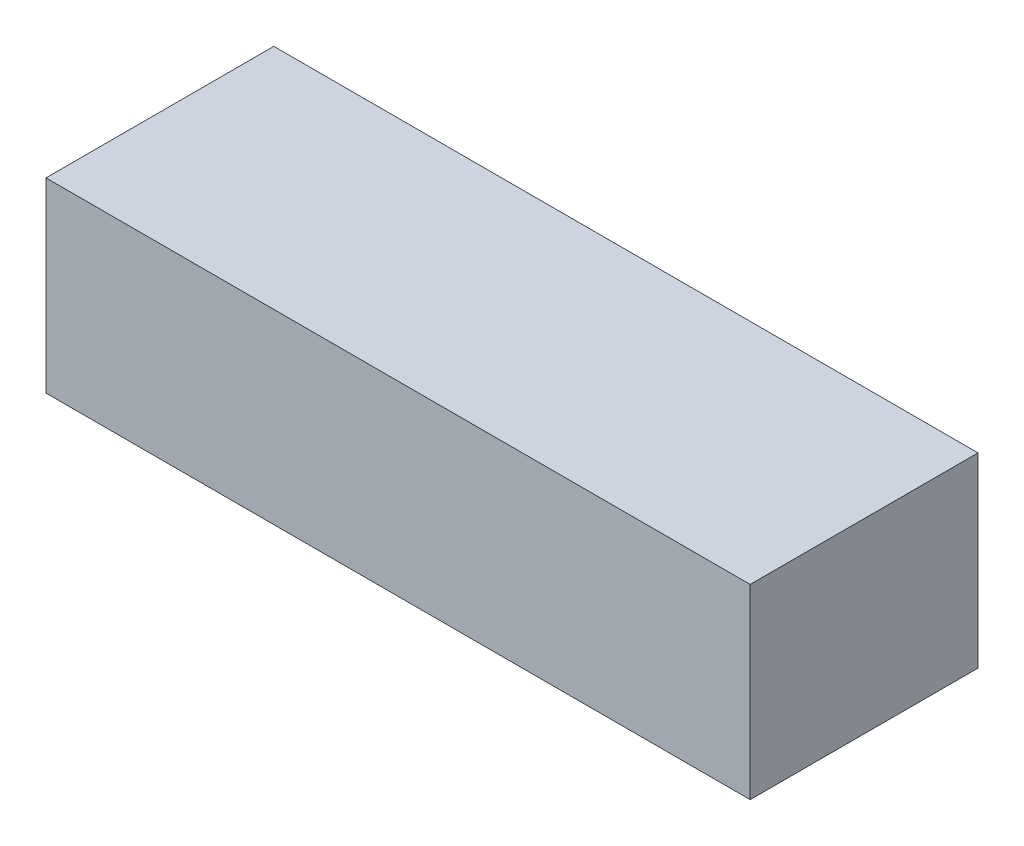
ISO-10303-21;
HEADER;
FILE_DESCRIPTION(('STEP AP214'),'2;1');
FILE_NAME('part.step','',(''),(''),'','','');
FILE_SCHEMA(('AUTOMOTIVE_DESIGN { 1 0 10303 214 1 1 1 1 }'));
ENDSEC;
DATA;
#1=APPLICATION_CONTEXT('core data for automotive mechanical design processes');
#2=APPLICATION_PROTOCOL_DEFINITION('international standard','automotive_design',2000,#1);
#3=PRODUCT_CONTEXT('',#1,'mechanical');
#4=PRODUCT('Part','Part','',(#3));
#5=PRODUCT_RELATED_PRODUCT_CATEGORY('part','',(#4));
#6=PRODUCT_DEFINITION_FORMATION('','',#4);
#7=PRODUCT_DEFINITION_CONTEXT('part definition',#1,'design');
#8=PRODUCT_DEFINITION('design','',#6,#7);
#9=PRODUCT_DEFINITION_SHAPE('','',#8);
#10=(LENGTH_UNIT() NAMED_UNIT(*) SI_UNIT(.MILLI.,.METRE.));
#11=(NAMED_UNIT(*) PLANE_ANGLE_UNIT() SI_UNIT($,.RADIAN.));
#12=(NAMED_UNIT(*) SI_UNIT($,.STERADIAN.) SOLID_ANGLE_UNIT());
#13=UNCERTAINTY_MEASURE_WITH_UNIT(LENGTH_MEASURE(1.E-05),#10,'distance_accuracy_value','');
#14=(GEOMETRIC_REPRESENTATION_CONTEXT(3) GLOBAL_UNCERTAINTY_ASSIGNED_CONTEXT((#13)) GLOBAL_UNIT_ASSIGNED_CONTEXT((#10,
#11,#12)) REPRESENTATION_CONTEXT('',''));
#15=CARTESIAN_POINT('',(0.,0.,0.));
#16=DIRECTION('',(0.,0.,1.));
#17=DIRECTION('',(1.,0.,0.));
#18=AXIS2_PLACEMENT_3D('',#15,#16,#17);
#19=CARTESIAN_POINT('',(0.,27.,0.));
#20=DIRECTION('',(1.,0.,0.));
#21=DIRECTION('',(0.,0.,-1.));
#22=AXIS2_PLACEMENT_3D('',#19,#20,#21);
#23=PLANE('',#22);
#24=DIRECTION('',(0.,0.,1.));
#25=VECTOR('',#24,1.);
#26=CARTESIAN_POINT('',(0.,0.,0.));
#27=LINE('',#26,#25);
#28=CARTESIAN_POINT('',(0.,0.,-33.));
#29=VERTEX_POINT('',#28);
#30=CARTESIAN_POINT('',(0.,0.,0.));
#31=VERTEX_POINT('',#30);
#32=EDGE_CURVE('E107',#29,#31,#27,.T.);
#33=ORIENTED_EDGE('',*,*,#32,.T.);
#34=DIRECTION('',(0.,-1.,0.));
#35=VECTOR('',#34,1.);
#36=CARTESIAN_POINT('',(0.,27.,0.));
#37=LINE('',#36,#35);
#38=CARTESIAN_POINT('',(0.,27.,0.));
#39=VERTEX_POINT('',#38);
#40=EDGE_CURVE('E11',#39,#31,#37,.T.);
#41=ORIENTED_EDGE('',*,*,#40,.F.);
#42=DIRECTION('',(0.,0.,1.));
#43=VECTOR('',#42,1.);
#44=CARTESIAN_POINT('',(0.,27.,0.));
#45=LINE('',#44,#43);
#46=CARTESIAN_POINT('',(0.,27.,-33.));
#47=VERTEX_POINT('',#46);
#48=EDGE_CURVE('E91',#47,#39,#45,.T.);
#49=ORIENTED_EDGE('',*,*,#48,.F.);
#50=DIRECTION('',(0.,-1.,0.));
#51=VECTOR('',#50,1.);
#52=CARTESIAN_POINT('',(0.,27.,-33.));
#53=LINE('',#52,#51);
#54=EDGE_CURVE('E103',#47,#29,#53,.T.);
#55=ORIENTED_EDGE('',*,*,#54,.T.);
#56=EDGE_LOOP('',(#33,#41,#49,#55));
#57=FACE_BOUND('',#56,.T.);
#58=ADVANCED_FACE('F39',(#57),#23,.F.);
#59=CARTESIAN_POINT('',(0.,27.,0.));
#60=DIRECTION('',(0.,0.,-1.));
#61=DIRECTION('',(-1.,0.,0.));
#62=AXIS2_PLACEMENT_3D('',#59,#60,#61);
#63=PLANE('',#62);
#64=DIRECTION('',(1.,0.,0.));
#65=VECTOR('',#64,1.);
#66=CARTESIAN_POINT('',(0.,0.,0.));
#67=LINE('',#66,#65);
#68=CARTESIAN_POINT('',(102.,0.,0.));
#69=VERTEX_POINT('',#68);
#70=EDGE_CURVE('E96',#31,#69,#67,.T.);
#71=ORIENTED_EDGE('',*,*,#70,.T.);
#72=DIRECTION('',(0.,-1.,0.));
#73=VECTOR('',#72,1.);
#74=CARTESIAN_POINT('',(102.,27.,0.));
#75=LINE('',#74,#73);
#76=CARTESIAN_POINT('',(102.,27.,0.));
#77=VERTEX_POINT('',#76);
#78=EDGE_CURVE('E48',#77,#69,#75,.T.);
#79=ORIENTED_EDGE('',*,*,#78,.F.);
#80=DIRECTION('',(1.,0.,0.));
#81=VECTOR('',#80,1.);
#82=CARTESIAN_POINT('',(0.,27.,0.));
#83=LINE('',#82,#81);
#84=EDGE_CURVE('E86',#39,#77,#83,.T.);
#85=ORIENTED_EDGE('',*,*,#84,.F.);
#86=ORIENTED_EDGE('',*,*,#40,.T.);
#87=EDGE_LOOP('',(#71,#79,#85,#86));
#88=FACE_BOUND('',#87,.T.);
#89=ADVANCED_FACE('F95',(#88),#63,.F.);
#90=CARTESIAN_POINT('',(102.,27.,0.));
#91=DIRECTION('',(-1.,0.,0.));
#92=DIRECTION('',(0.,0.,1.));
#93=AXIS2_PLACEMENT_3D('',#90,#91,#92);
#94=PLANE('',#93);
#95=DIRECTION('',(0.,0.,-1.));
#96=VECTOR('',#95,1.);
#97=CARTESIAN_POINT('',(102.,0.,0.));
#98=LINE('',#97,#96);
#99=CARTESIAN_POINT('',(102.,0.,-33.));
#100=VERTEX_POINT('',#99);
#101=EDGE_CURVE('E73',#69,#100,#98,.T.);
#102=ORIENTED_EDGE('',*,*,#101,.T.);
#103=DIRECTION('',(0.,-1.,0.));
#104=VECTOR('',#103,1.);
#105=CARTESIAN_POINT('',(102.,27.,-33.));
#106=LINE('',#105,#104);
#107=CARTESIAN_POINT('',(102.,27.,-33.));
#108=VERTEX_POINT('',#107);
#109=EDGE_CURVE('E98',#108,#100,#106,.T.);
#110=ORIENTED_EDGE('',*,*,#109,.F.);
#111=DIRECTION('',(0.,0.,-1.));
#112=VECTOR('',#111,1.);
#113=CARTESIAN_POINT('',(102.,27.,0.));
#114=LINE('',#113,#112);
#115=EDGE_CURVE('E89',#77,#108,#114,.T.);
#116=ORIENTED_EDGE('',*,*,#115,.F.);
#117=ORIENTED_EDGE('',*,*,#78,.T.);
#118=EDGE_LOOP('',(#102,#110,#116,#117));
#119=FACE_BOUND('',#118,.T.);
#120=ADVANCED_FACE('F99',(#119),#94,.F.);
#121=CARTESIAN_POINT('',(0.,27.,-33.));
#122=DIRECTION('',(0.,0.,1.));
#123=DIRECTION('',(1.,0.,0.));
#124=AXIS2_PLACEMENT_3D('',#121,#122,#123);
#125=PLANE('',#124);
#126=DIRECTION('',(-1.,0.,0.));
#127=VECTOR('',#126,1.);
#128=CARTESIAN_POINT('',(0.,0.,-33.));
#129=LINE('',#128,#127);
#130=EDGE_CURVE('E79',#100,#29,#129,.T.);
#131=ORIENTED_EDGE('',*,*,#130,.T.);
#132=ORIENTED_EDGE('',*,*,#54,.F.);
#133=DIRECTION('',(-1.,0.,0.));
#134=VECTOR('',#133,1.);
#135=CARTESIAN_POINT('',(0.,27.,-33.));
#136=LINE('',#135,#134);
#137=EDGE_CURVE('E56',#108,#47,#136,.T.);
#138=ORIENTED_EDGE('',*,*,#137,.F.);
#139=ORIENTED_EDGE('',*,*,#109,.T.);
#140=EDGE_LOOP('',(#131,#132,#138,#139));
#141=FACE_BOUND('',#140,.T.);
#142=ADVANCED_FACE('F120',(#141),#125,.F.);
#143=CARTESIAN_POINT('',(0.,27.,0.));
#144=DIRECTION('',(0.,-1.,0.));
#145=DIRECTION('',(0.,0.,-1.));
#146=AXIS2_PLACEMENT_3D('',#143,#144,#145);
#147=PLANE('',#146);
#148=ORIENTED_EDGE('',*,*,#48,.T.);
#149=ORIENTED_EDGE('',*,*,#84,.T.);
#150=ORIENTED_EDGE('',*,*,#115,.T.);
#151=ORIENTED_EDGE('',*,*,#137,.T.);
#152=EDGE_LOOP('',(#148,#149,#150,#151));
#153=FACE_BOUND('',#152,.T.);
#154=ADVANCED_FACE('F87',(#153),#147,.F.);
#155=CARTESIAN_POINT('',(0.,0.,0.));
#156=DIRECTION('',(0.,-1.,0.));
#157=DIRECTION('',(0.,0.,-1.));
#158=AXIS2_PLACEMENT_3D('',#155,#156,#157);
#159=PLANE('',#158);
#160=ORIENTED_EDGE('',*,*,#32,.F.);
#161=ORIENTED_EDGE('',*,*,#130,.F.);
#162=ORIENTED_EDGE('',*,*,#101,.F.);
#163=ORIENTED_EDGE('',*,*,#70,.F.);
#164=EDGE_LOOP('',(#160,#161,#162,#163));
#165=FACE_BOUND('',#164,.T.);
#166=ADVANCED_FACE('F123',(#165),#159,.T.);
#167=CLOSED_SHELL('',(#58,#89,#120,#142,#154,#166));
#168=MANIFOLD_SOLID_BREP('B2',#167);
#169=ADVANCED_BREP_SHAPE_REPRESENTATION('',(#18,#168),#14);
#170=SHAPE_DEFINITION_REPRESENTATION(#9,#169);
ENDSEC;
END-ISO-10303-21;
